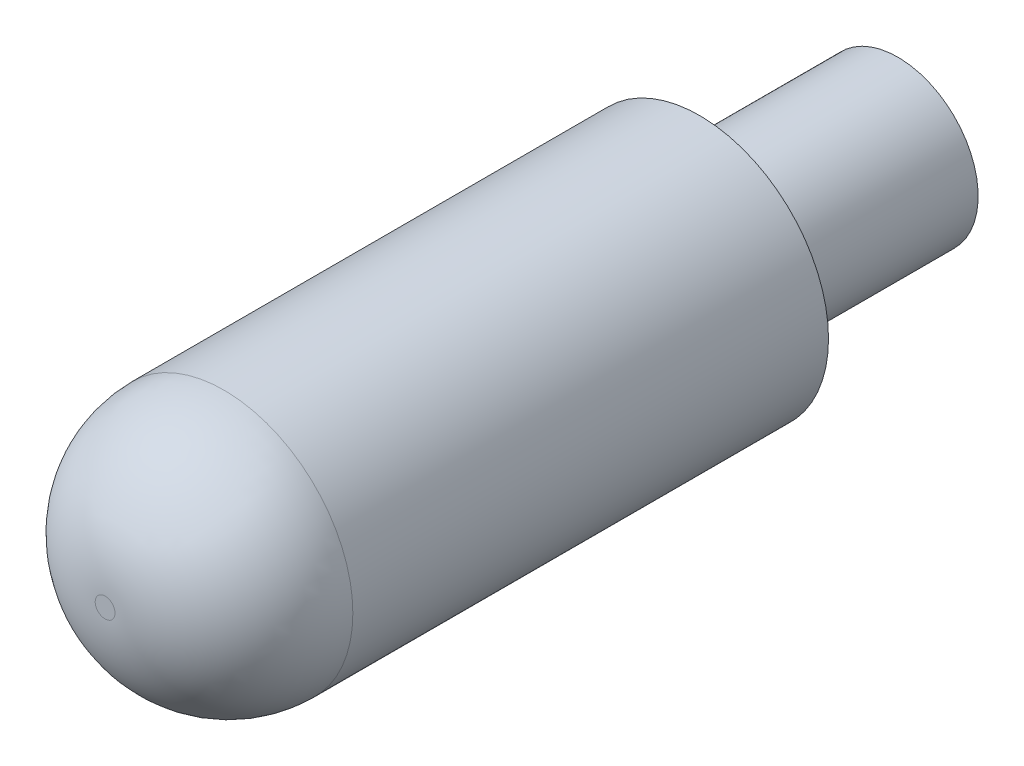
ISO-10303-21;
HEADER;
FILE_DESCRIPTION(('STEP AP214'),'2;1');
FILE_NAME('part.step','',(''),(''),'','','');
FILE_SCHEMA(('AUTOMOTIVE_DESIGN { 1 0 10303 214 1 1 1 1 }'));
ENDSEC;
DATA;
#1=APPLICATION_CONTEXT('core data for automotive mechanical design processes');
#2=APPLICATION_PROTOCOL_DEFINITION('international standard','automotive_design',2000,#1);
#3=PRODUCT_CONTEXT('',#1,'mechanical');
#4=PRODUCT('Part','Part','',(#3));
#5=PRODUCT_RELATED_PRODUCT_CATEGORY('part','',(#4));
#6=PRODUCT_DEFINITION_FORMATION('','',#4);
#7=PRODUCT_DEFINITION_CONTEXT('part definition',#1,'design');
#8=PRODUCT_DEFINITION('design','',#6,#7);
#9=PRODUCT_DEFINITION_SHAPE('','',#8);
#10=(LENGTH_UNIT() NAMED_UNIT(*) SI_UNIT(.MILLI.,.METRE.));
#11=(NAMED_UNIT(*) PLANE_ANGLE_UNIT() SI_UNIT($,.RADIAN.));
#12=(NAMED_UNIT(*) SI_UNIT($,.STERADIAN.) SOLID_ANGLE_UNIT());
#13=UNCERTAINTY_MEASURE_WITH_UNIT(LENGTH_MEASURE(1.E-05),#10,'distance_accuracy_value','');
#14=(GEOMETRIC_REPRESENTATION_CONTEXT(3) GLOBAL_UNCERTAINTY_ASSIGNED_CONTEXT((#13)) GLOBAL_UNIT_ASSIGNED_CONTEXT((#10,
#11,#12)) REPRESENTATION_CONTEXT('',''));
#15=CARTESIAN_POINT('',(0.,0.,0.));
#16=DIRECTION('',(0.,0.,1.));
#17=DIRECTION('',(1.,0.,0.));
#18=AXIS2_PLACEMENT_3D('',#15,#16,#17);
#19=CARTESIAN_POINT('',(0.,0.,30.));
#20=DIRECTION('',(0.,0.,-1.));
#21=DIRECTION('',(-1.,0.,0.));
#22=AXIS2_PLACEMENT_3D('',#19,#20,#21);
#23=CYLINDRICAL_SURFACE('',#22,6.5);
#24=CARTESIAN_POINT('',(0.,0.,24.));
#25=DIRECTION('',(0.,0.,1.));
#26=DIRECTION('',(1.,0.,0.));
#27=AXIS2_PLACEMENT_3D('',#24,#25,#26);
#28=CIRCLE('',#27,6.5);
#29=CARTESIAN_POINT('',(6.5,0.,24.));
#30=VERTEX_POINT('',#29);
#31=EDGE_CURVE('E10',#30,#30,#28,.F.);
#32=ORIENTED_EDGE('',*,*,#31,.T.);
#33=EDGE_LOOP('',(#32));
#34=FACE_BOUND('',#33,.T.);
#35=CARTESIAN_POINT('',(0.,0.,0.));
#36=DIRECTION('',(0.,0.,1.));
#37=DIRECTION('',(1.,0.,0.));
#38=AXIS2_PLACEMENT_3D('',#35,#36,#37);
#39=CIRCLE('',#38,6.5);
#40=CARTESIAN_POINT('',(6.5,0.,0.));
#41=VERTEX_POINT('',#40);
#42=EDGE_CURVE('E47',#41,#41,#39,.T.);
#43=ORIENTED_EDGE('',*,*,#42,.T.);
#44=EDGE_LOOP('',(#43));
#45=FACE_BOUND('',#44,.T.);
#46=ADVANCED_FACE('F32',(#34,#45),#23,.T.);
#47=CARTESIAN_POINT('',(0.,0.,30.));
#48=DIRECTION('',(0.,0.,1.));
#49=DIRECTION('',(1.,0.,0.));
#50=AXIS2_PLACEMENT_3D('',#47,#48,#49);
#51=PLANE('',#50);
#52=CARTESIAN_POINT('',(0.,0.,30.));
#53=DIRECTION('',(0.,0.,1.));
#54=DIRECTION('',(1.,0.,0.));
#55=AXIS2_PLACEMENT_3D('',#52,#53,#54);
#56=CIRCLE('',#55,0.5);
#57=CARTESIAN_POINT('',(0.5,0.,30.));
#58=VERTEX_POINT('',#57);
#59=EDGE_CURVE('E39',#58,#58,#56,.T.);
#60=ORIENTED_EDGE('',*,*,#59,.T.);
#61=EDGE_LOOP('',(#60));
#62=FACE_BOUND('',#61,.T.);
#63=ADVANCED_FACE('F67',(#62),#51,.T.);
#64=CARTESIAN_POINT('',(0.,0.,0.));
#65=DIRECTION('',(0.,0.,1.));
#66=DIRECTION('',(1.,0.,0.));
#67=AXIS2_PLACEMENT_3D('',#64,#65,#66);
#68=PLANE('',#67);
#69=CARTESIAN_POINT('',(0.,0.,0.));
#70=DIRECTION('',(0.,0.,-1.));
#71=DIRECTION('',(-1.,0.,0.));
#72=AXIS2_PLACEMENT_3D('',#69,#70,#71);
#73=CIRCLE('',#72,4.05);
#74=CARTESIAN_POINT('',(-4.05,0.,0.));
#75=VERTEX_POINT('',#74);
#76=EDGE_CURVE('E43',#75,#75,#73,.T.);
#77=ORIENTED_EDGE('',*,*,#76,.F.);
#78=EDGE_LOOP('',(#77));
#79=FACE_BOUND('',#78,.T.);
#80=ORIENTED_EDGE('',*,*,#42,.F.);
#81=EDGE_LOOP('',(#80));
#82=FACE_BOUND('',#81,.T.);
#83=ADVANCED_FACE('F61',(#79,#82),#68,.F.);
#84=CARTESIAN_POINT('',(0.,0.,-10.));
#85=DIRECTION('',(0.,0.,1.));
#86=DIRECTION('',(1.,0.,0.));
#87=AXIS2_PLACEMENT_3D('',#84,#85,#86);
#88=CYLINDRICAL_SURFACE('',#87,4.05);
#89=CARTESIAN_POINT('',(0.,0.,-10.));
#90=DIRECTION('',(0.,0.,-1.));
#91=DIRECTION('',(-1.,0.,0.));
#92=AXIS2_PLACEMENT_3D('',#89,#90,#91);
#93=CIRCLE('',#92,4.05);
#94=CARTESIAN_POINT('',(-4.05,0.,-10.));
#95=VERTEX_POINT('',#94);
#96=EDGE_CURVE('E51',#95,#95,#93,.T.);
#97=ORIENTED_EDGE('',*,*,#96,.F.);
#98=EDGE_LOOP('',(#97));
#99=FACE_BOUND('',#98,.T.);
#100=ORIENTED_EDGE('',*,*,#76,.T.);
#101=EDGE_LOOP('',(#100));
#102=FACE_BOUND('',#101,.T.);
#103=ADVANCED_FACE('F58',(#99,#102),#88,.T.);
#104=CARTESIAN_POINT('',(0.,0.,-10.));
#105=DIRECTION('',(0.,0.,-1.));
#106=DIRECTION('',(-1.,0.,0.));
#107=AXIS2_PLACEMENT_3D('',#104,#105,#106);
#108=PLANE('',#107);
#109=ORIENTED_EDGE('',*,*,#96,.T.);
#110=EDGE_LOOP('',(#109));
#111=FACE_BOUND('',#110,.T.);
#112=ADVANCED_FACE('F56',(#111),#108,.T.);
#113=CARTESIAN_POINT('',(0.,0.,24.));
#114=DIRECTION('',(0.,0.,1.));
#115=DIRECTION('',(1.,0.,0.));
#116=AXIS2_PLACEMENT_3D('',#113,#114,#115);
#117=DEGENERATE_TOROIDAL_SURFACE('',#116,0.5,6.,.T.);
#118=ORIENTED_EDGE('',*,*,#31,.F.);
#119=EDGE_LOOP('',(#118));
#120=FACE_BOUND('',#119,.T.);
#121=ORIENTED_EDGE('',*,*,#59,.F.);
#122=EDGE_LOOP('',(#121));
#123=FACE_BOUND('',#122,.T.);
#124=ADVANCED_FACE('F34',(#120,#123),#117,.T.);
#125=CLOSED_SHELL('',(#46,#63,#83,#103,#112,#124));
#126=MANIFOLD_SOLID_BREP('B2',#125);
#127=ADVANCED_BREP_SHAPE_REPRESENTATION('',(#18,#126),#14);
#128=SHAPE_DEFINITION_REPRESENTATION(#9,#127);
ENDSEC;
END-ISO-10303-21;
